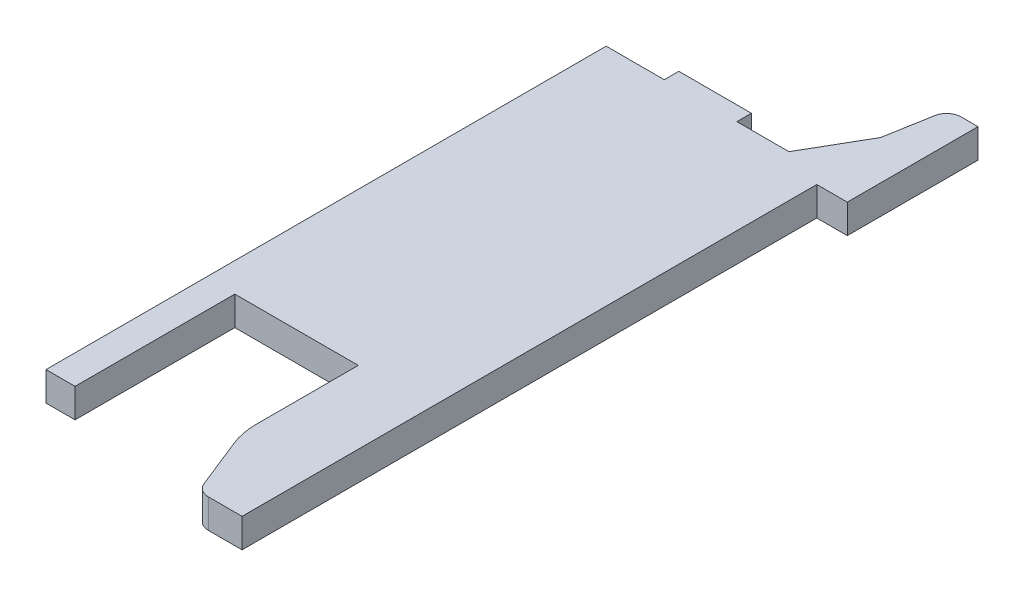
ISO-10303-21;
HEADER;
FILE_DESCRIPTION(('STEP AP214'),'2;1');
FILE_NAME('part.step','',(''),(''),'','','');
FILE_SCHEMA(('AUTOMOTIVE_DESIGN { 1 0 10303 214 1 1 1 1 }'));
ENDSEC;
DATA;
#1=APPLICATION_CONTEXT('core data for automotive mechanical design processes');
#2=APPLICATION_PROTOCOL_DEFINITION('international standard','automotive_design',2000,#1);
#3=PRODUCT_CONTEXT('',#1,'mechanical');
#4=PRODUCT('Part','Part','',(#3));
#5=PRODUCT_RELATED_PRODUCT_CATEGORY('part','',(#4));
#6=PRODUCT_DEFINITION_FORMATION('','',#4);
#7=PRODUCT_DEFINITION_CONTEXT('part definition',#1,'design');
#8=PRODUCT_DEFINITION('design','',#6,#7);
#9=PRODUCT_DEFINITION_SHAPE('','',#8);
#10=(LENGTH_UNIT() NAMED_UNIT(*) SI_UNIT(.MILLI.,.METRE.));
#11=(NAMED_UNIT(*) PLANE_ANGLE_UNIT() SI_UNIT($,.RADIAN.));
#12=(NAMED_UNIT(*) SI_UNIT($,.STERADIAN.) SOLID_ANGLE_UNIT());
#13=UNCERTAINTY_MEASURE_WITH_UNIT(LENGTH_MEASURE(1.E-05),#10,'distance_accuracy_value','');
#14=(GEOMETRIC_REPRESENTATION_CONTEXT(3) GLOBAL_UNCERTAINTY_ASSIGNED_CONTEXT((#13)) GLOBAL_UNIT_ASSIGNED_CONTEXT((#10,
#11,#12)) REPRESENTATION_CONTEXT('',''));
#15=CARTESIAN_POINT('',(0.,0.,0.));
#16=DIRECTION('',(0.,0.,1.));
#17=DIRECTION('',(1.,0.,0.));
#18=AXIS2_PLACEMENT_3D('',#15,#16,#17);
#19=CARTESIAN_POINT('',(0.868909963118,-0.1,-1.1));
#20=DIRECTION('',(0.,1.,0.));
#21=DIRECTION('',(0.,0.,1.));
#22=AXIS2_PLACEMENT_3D('',#19,#20,#21);
#23=CYLINDRICAL_SURFACE('',#22,0.1);
#24=CARTESIAN_POINT('',(0.868909963118,-0.1,-1.1));
#25=DIRECTION('',(0.,-1.,0.));
#26=DIRECTION('',(0.,0.,-1.));
#27=AXIS2_PLACEMENT_3D('',#24,#25,#26);
#28=CIRCLE('',#27,0.1);
#29=CARTESIAN_POINT('',(0.770429187817,-0.1,-1.117364817767));
#30=VERTEX_POINT('',#29);
#31=CARTESIAN_POINT('',(0.868909963118,-0.1,-1.2));
#32=VERTEX_POINT('',#31);
#33=EDGE_CURVE('E26',#30,#32,#28,.T.);
#34=ORIENTED_EDGE('',*,*,#33,.F.);
#35=DIRECTION('',(0.,-1.,0.));
#36=VECTOR('',#35,1.);
#37=CARTESIAN_POINT('',(0.770429187817,-0.1,-1.117364817767));
#38=LINE('',#37,#36);
#39=CARTESIAN_POINT('',(0.770429187817,0.1,-1.117364817767));
#40=VERTEX_POINT('',#39);
#41=EDGE_CURVE('E258',#40,#30,#38,.T.);
#42=ORIENTED_EDGE('',*,*,#41,.F.);
#43=CARTESIAN_POINT('',(0.868909963118,0.1,-1.1));
#44=DIRECTION('',(0.,1.,0.));
#45=DIRECTION('',(0.,0.,-1.));
#46=AXIS2_PLACEMENT_3D('',#43,#44,#45);
#47=CIRCLE('',#46,0.1);
#48=CARTESIAN_POINT('',(0.868909963118,0.1,-1.2));
#49=VERTEX_POINT('',#48);
#50=EDGE_CURVE('E11',#49,#40,#47,.T.);
#51=ORIENTED_EDGE('',*,*,#50,.F.);
#52=DIRECTION('',(0.,1.,0.));
#53=VECTOR('',#52,1.);
#54=CARTESIAN_POINT('',(0.868909963118,-0.1,-1.2));
#55=LINE('',#54,#53);
#56=EDGE_CURVE('E274',#32,#49,#55,.T.);
#57=ORIENTED_EDGE('',*,*,#56,.F.);
#58=EDGE_LOOP('',(#34,#42,#51,#57));
#59=FACE_BOUND('',#58,.T.);
#60=ADVANCED_FACE('F17',(#59),#23,.T.);
#61=CARTESIAN_POINT('',(0.775,0.1,3.060583310795));
#62=DIRECTION('',(0.,-1.,0.));
#63=DIRECTION('',(0.,0.,-1.));
#64=AXIS2_PLACEMENT_3D('',#61,#62,#63);
#65=PLANE('',#64);
#66=DIRECTION('',(-1.,0.,0.));
#67=VECTOR('',#66,1.);
#68=CARTESIAN_POINT('',(0.985,0.1,-1.2));
#69=LINE('',#68,#67);
#70=CARTESIAN_POINT('',(0.985,0.1,-1.2));
#71=VERTEX_POINT('',#70);
#72=EDGE_CURVE('E283',#71,#49,#69,.T.);
#73=ORIENTED_EDGE('',*,*,#72,.T.);
#74=ORIENTED_EDGE('',*,*,#50,.T.);
#75=DIRECTION('',(-0.173648177667033,0.,0.98480775301219));
#76=VECTOR('',#75,1.);
#77=CARTESIAN_POINT('',(0.785,0.1,-1.2));
#78=LINE('',#77,#76);
#79=CARTESIAN_POINT('',(0.714469207717,0.1,-0.8));
#80=VERTEX_POINT('',#79);
#81=EDGE_CURVE('E221',#40,#80,#78,.T.);
#82=ORIENTED_EDGE('',*,*,#81,.T.);
#83=DIRECTION('',(-0.50000000000019,0.,0.866025403784329));
#84=VECTOR('',#83,1.);
#85=CARTESIAN_POINT('',(0.714469207717,0.1,-0.8));
#86=LINE('',#85,#84);
#87=CARTESIAN_POINT('',(0.483529100041,0.1,-0.4));
#88=VERTEX_POINT('',#87);
#89=EDGE_CURVE('E232',#80,#88,#86,.T.);
#90=ORIENTED_EDGE('',*,*,#89,.T.);
#91=DIRECTION('',(-1.,0.,0.));
#92=VECTOR('',#91,1.);
#93=CARTESIAN_POINT('',(0.125,0.1,-0.4));
#94=LINE('',#93,#92);
#95=CARTESIAN_POINT('',(0.125,0.1,-0.4));
#96=VERTEX_POINT('',#95);
#97=EDGE_CURVE('E235',#88,#96,#94,.T.);
#98=ORIENTED_EDGE('',*,*,#97,.T.);
#99=DIRECTION('',(0.,0.,-1.));
#100=VECTOR('',#99,1.);
#101=CARTESIAN_POINT('',(0.125,0.1,-0.4));
#102=LINE('',#101,#100);
#103=CARTESIAN_POINT('',(0.125,0.1,-0.5));
#104=VERTEX_POINT('',#103);
#105=EDGE_CURVE('E373',#96,#104,#102,.T.);
#106=ORIENTED_EDGE('',*,*,#105,.T.);
#107=DIRECTION('',(-1.,0.,0.));
#108=VECTOR('',#107,1.);
#109=CARTESIAN_POINT('',(-0.375,0.1,-0.5));
#110=LINE('',#109,#108);
#111=CARTESIAN_POINT('',(-0.375,0.1,-0.5));
#112=VERTEX_POINT('',#111);
#113=EDGE_CURVE('E388',#104,#112,#110,.T.);
#114=ORIENTED_EDGE('',*,*,#113,.T.);
#115=DIRECTION('',(0.,0.,1.));
#116=VECTOR('',#115,1.);
#117=CARTESIAN_POINT('',(-0.375,0.1,-0.4));
#118=LINE('',#117,#116);
#119=CARTESIAN_POINT('',(-0.375,0.1,-0.4));
#120=VERTEX_POINT('',#119);
#121=EDGE_CURVE('E379',#112,#120,#118,.T.);
#122=ORIENTED_EDGE('',*,*,#121,.T.);
#123=DIRECTION('',(-1.,0.,0.));
#124=VECTOR('',#123,1.);
#125=CARTESIAN_POINT('',(-0.775,0.1,-0.4));
#126=LINE('',#125,#124);
#127=CARTESIAN_POINT('',(-0.775,0.1,-0.4));
#128=VERTEX_POINT('',#127);
#129=EDGE_CURVE('E365',#120,#128,#126,.T.);
#130=ORIENTED_EDGE('',*,*,#129,.T.);
#131=DIRECTION('',(0.,0.,1.));
#132=VECTOR('',#131,1.);
#133=CARTESIAN_POINT('',(-0.775,0.1,-0.4));
#134=LINE('',#133,#132);
#135=CARTESIAN_POINT('',(-0.775,0.1,3.456874512579));
#136=VERTEX_POINT('',#135);
#137=EDGE_CURVE('E424',#128,#136,#134,.T.);
#138=ORIENTED_EDGE('',*,*,#137,.T.);
#139=DIRECTION('',(1.,0.,0.));
#140=VECTOR('',#139,1.);
#141=CARTESIAN_POINT('',(-0.775,0.1,3.456874512579));
#142=LINE('',#141,#140);
#143=CARTESIAN_POINT('',(-0.575,0.1,3.456874512579));
#144=VERTEX_POINT('',#143);
#145=EDGE_CURVE('E20',#136,#144,#142,.T.);
#146=ORIENTED_EDGE('',*,*,#145,.T.);
#147=DIRECTION('',(0.,0.,-1.));
#148=VECTOR('',#147,1.);
#149=CARTESIAN_POINT('',(-0.575,0.1,2.356874512579));
#150=LINE('',#149,#148);
#151=CARTESIAN_POINT('',(-0.575,0.1,2.356874512579));
#152=VERTEX_POINT('',#151);
#153=EDGE_CURVE('E340',#144,#152,#150,.T.);
#154=ORIENTED_EDGE('',*,*,#153,.T.);
#155=DIRECTION('',(1.,0.,0.));
#156=VECTOR('',#155,1.);
#157=CARTESIAN_POINT('',(-0.575,0.1,2.356874512579));
#158=LINE('',#157,#156);
#159=CARTESIAN_POINT('',(0.275,0.1,2.356874512579));
#160=VERTEX_POINT('',#159);
#161=EDGE_CURVE('E332',#152,#160,#158,.T.);
#162=ORIENTED_EDGE('',*,*,#161,.T.);
#163=DIRECTION('',(0.,0.,1.));
#164=VECTOR('',#163,1.);
#165=CARTESIAN_POINT('',(0.275,0.1,2.356874512579));
#166=LINE('',#165,#164);
#167=CARTESIAN_POINT('',(0.275,0.1,3.060583310795));
#168=VERTEX_POINT('',#167);
#169=EDGE_CURVE('E278',#160,#168,#166,.T.);
#170=ORIENTED_EDGE('',*,*,#169,.T.);
#171=CARTESIAN_POINT('',(0.775,0.1,3.060583310795));
#172=DIRECTION('',(0.,1.,0.));
#173=DIRECTION('',(0.,0.,-1.));
#174=AXIS2_PLACEMENT_3D('',#171,#172,#173);
#175=CIRCLE('',#174,0.5);
#176=CARTESIAN_POINT('',(0.310761654557,0.1,3.246278648972));
#177=VERTEX_POINT('',#176);
#178=EDGE_CURVE('E269',#168,#177,#175,.T.);
#179=ORIENTED_EDGE('',*,*,#178,.T.);
#180=DIRECTION('',(0.371390676354104,0.,0.928476690885259));
#181=VECTOR('',#180,1.);
#182=CARTESIAN_POINT('',(0.449855627054,0.1,3.594013580214));
#183=LINE('',#182,#181);
#184=CARTESIAN_POINT('',(0.449855627054,0.1,3.594013580214));
#185=VERTEX_POINT('',#184);
#186=EDGE_CURVE('E287',#177,#185,#183,.T.);
#187=ORIENTED_EDGE('',*,*,#186,.T.);
#188=CARTESIAN_POINT('',(0.542703296143,0.1,3.556874512579));
#189=DIRECTION('',(0.,1.,0.));
#190=DIRECTION('',(0.,0.,1.));
#191=AXIS2_PLACEMENT_3D('',#188,#189,#190);
#192=CIRCLE('',#191,0.1);
#193=CARTESIAN_POINT('',(0.542703296143,0.1,3.656874512579));
#194=VERTEX_POINT('',#193);
#195=EDGE_CURVE('E313',#185,#194,#192,.T.);
#196=ORIENTED_EDGE('',*,*,#195,.T.);
#197=DIRECTION('',(1.,0.,0.));
#198=VECTOR('',#197,1.);
#199=CARTESIAN_POINT('',(0.775,0.1,3.656874512579));
#200=LINE('',#199,#198);
#201=CARTESIAN_POINT('',(0.775,0.1,3.656874512579));
#202=VERTEX_POINT('',#201);
#203=EDGE_CURVE('E305',#194,#202,#200,.T.);
#204=ORIENTED_EDGE('',*,*,#203,.T.);
#205=DIRECTION('',(0.,0.,-1.));
#206=VECTOR('',#205,1.);
#207=CARTESIAN_POINT('',(0.775,0.1,-0.3));
#208=LINE('',#207,#206);
#209=CARTESIAN_POINT('',(0.775,0.1,-0.3));
#210=VERTEX_POINT('',#209);
#211=EDGE_CURVE('E301',#202,#210,#208,.T.);
#212=ORIENTED_EDGE('',*,*,#211,.T.);
#213=DIRECTION('',(1.,0.,0.));
#214=VECTOR('',#213,1.);
#215=CARTESIAN_POINT('',(0.775,0.1,-0.3));
#216=LINE('',#215,#214);
#217=CARTESIAN_POINT('',(0.985,0.1,-0.3));
#218=VERTEX_POINT('',#217);
#219=EDGE_CURVE('E293',#210,#218,#216,.T.);
#220=ORIENTED_EDGE('',*,*,#219,.T.);
#221=DIRECTION('',(0.,0.,-1.));
#222=VECTOR('',#221,1.);
#223=CARTESIAN_POINT('',(0.985,0.1,-0.4));
#224=LINE('',#223,#222);
#225=EDGE_CURVE('E250',#218,#71,#224,.T.);
#226=ORIENTED_EDGE('',*,*,#225,.T.);
#227=EDGE_LOOP('',(#73,#74,#82,#90,#98,#106,#114,#122,#130,#138,#146,#154,#162,#170,#179,#187,
#196,#204,#212,#220,#226));
#228=FACE_BOUND('',#227,.T.);
#229=ADVANCED_FACE('F407',(#228),#65,.F.);
#230=CARTESIAN_POINT('',(0.775,-0.1,3.060583310795));
#231=DIRECTION('',(0.,-1.,0.));
#232=DIRECTION('',(0.,0.,-1.));
#233=AXIS2_PLACEMENT_3D('',#230,#231,#232);
#234=PLANE('',#233);
#235=DIRECTION('',(-0.173648177667033,0.,0.98480775301219));
#236=VECTOR('',#235,1.);
#237=CARTESIAN_POINT('',(0.785,-0.1,-1.2));
#238=LINE('',#237,#236);
#239=CARTESIAN_POINT('',(0.714469207717,-0.1,-0.8));
#240=VERTEX_POINT('',#239);
#241=EDGE_CURVE('E262',#30,#240,#238,.T.);
#242=ORIENTED_EDGE('',*,*,#241,.F.);
#243=ORIENTED_EDGE('',*,*,#33,.T.);
#244=DIRECTION('',(-1.,0.,0.));
#245=VECTOR('',#244,1.);
#246=CARTESIAN_POINT('',(0.985,-0.1,-1.2));
#247=LINE('',#246,#245);
#248=CARTESIAN_POINT('',(0.985,-0.1,-1.2));
#249=VERTEX_POINT('',#248);
#250=EDGE_CURVE('E265',#249,#32,#247,.T.);
#251=ORIENTED_EDGE('',*,*,#250,.F.);
#252=DIRECTION('',(0.,0.,-1.));
#253=VECTOR('',#252,1.);
#254=CARTESIAN_POINT('',(0.985,-0.1,-0.4));
#255=LINE('',#254,#253);
#256=CARTESIAN_POINT('',(0.985,-0.1,-0.3));
#257=VERTEX_POINT('',#256);
#258=EDGE_CURVE('E249',#257,#249,#255,.T.);
#259=ORIENTED_EDGE('',*,*,#258,.F.);
#260=DIRECTION('',(1.,0.,0.));
#261=VECTOR('',#260,1.);
#262=CARTESIAN_POINT('',(0.775,-0.1,-0.3));
#263=LINE('',#262,#261);
#264=CARTESIAN_POINT('',(0.775,-0.1,-0.3));
#265=VERTEX_POINT('',#264);
#266=EDGE_CURVE('E298',#265,#257,#263,.T.);
#267=ORIENTED_EDGE('',*,*,#266,.F.);
#268=DIRECTION('',(0.,0.,-1.));
#269=VECTOR('',#268,1.);
#270=CARTESIAN_POINT('',(0.775,-0.1,-0.3));
#271=LINE('',#270,#269);
#272=CARTESIAN_POINT('',(0.775,-0.1,3.656874512579));
#273=VERTEX_POINT('',#272);
#274=EDGE_CURVE('E302',#273,#265,#271,.T.);
#275=ORIENTED_EDGE('',*,*,#274,.F.);
#276=DIRECTION('',(1.,0.,0.));
#277=VECTOR('',#276,1.);
#278=CARTESIAN_POINT('',(0.775,-0.1,3.656874512579));
#279=LINE('',#278,#277);
#280=CARTESIAN_POINT('',(0.542703296143,-0.1,3.656874512579));
#281=VERTEX_POINT('',#280);
#282=EDGE_CURVE('E310',#281,#273,#279,.T.);
#283=ORIENTED_EDGE('',*,*,#282,.F.);
#284=CARTESIAN_POINT('',(0.542703296143,-0.1,3.556874512579));
#285=DIRECTION('',(0.,1.,0.));
#286=DIRECTION('',(0.,0.,1.));
#287=AXIS2_PLACEMENT_3D('',#284,#285,#286);
#288=CIRCLE('',#287,0.1);
#289=CARTESIAN_POINT('',(0.449855627054,-0.1,3.594013580214));
#290=VERTEX_POINT('',#289);
#291=EDGE_CURVE('E290',#290,#281,#288,.T.);
#292=ORIENTED_EDGE('',*,*,#291,.F.);
#293=DIRECTION('',(0.371390676354104,0.,0.928476690885259));
#294=VECTOR('',#293,1.);
#295=CARTESIAN_POINT('',(0.449855627054,-0.1,3.594013580214));
#296=LINE('',#295,#294);
#297=CARTESIAN_POINT('',(0.310761654557,-0.1,3.246278648972));
#298=VERTEX_POINT('',#297);
#299=EDGE_CURVE('E266',#298,#290,#296,.T.);
#300=ORIENTED_EDGE('',*,*,#299,.F.);
#301=CARTESIAN_POINT('',(0.775,-0.1,3.060583310795));
#302=DIRECTION('',(0.,1.,0.));
#303=DIRECTION('',(0.,0.,-1.));
#304=AXIS2_PLACEMENT_3D('',#301,#302,#303);
#305=CIRCLE('',#304,0.5);
#306=CARTESIAN_POINT('',(0.275,-0.1,3.060583310795));
#307=VERTEX_POINT('',#306);
#308=EDGE_CURVE('E275',#307,#298,#305,.T.);
#309=ORIENTED_EDGE('',*,*,#308,.F.);
#310=DIRECTION('',(0.,0.,1.));
#311=VECTOR('',#310,1.);
#312=CARTESIAN_POINT('',(0.275,-0.1,2.356874512579));
#313=LINE('',#312,#311);
#314=CARTESIAN_POINT('',(0.275,-0.1,2.356874512579));
#315=VERTEX_POINT('',#314);
#316=EDGE_CURVE('E329',#315,#307,#313,.T.);
#317=ORIENTED_EDGE('',*,*,#316,.F.);
#318=DIRECTION('',(1.,0.,0.));
#319=VECTOR('',#318,1.);
#320=CARTESIAN_POINT('',(-0.575,-0.1,2.356874512579));
#321=LINE('',#320,#319);
#322=CARTESIAN_POINT('',(-0.575,-0.1,2.356874512579));
#323=VERTEX_POINT('',#322);
#324=EDGE_CURVE('E339',#323,#315,#321,.T.);
#325=ORIENTED_EDGE('',*,*,#324,.F.);
#326=DIRECTION('',(0.,0.,-1.));
#327=VECTOR('',#326,1.);
#328=CARTESIAN_POINT('',(-0.575,-0.1,2.356874512579));
#329=LINE('',#328,#327);
#330=CARTESIAN_POINT('',(-0.575,-0.1,3.456874512579));
#331=VERTEX_POINT('',#330);
#332=EDGE_CURVE('E345',#331,#323,#329,.T.);
#333=ORIENTED_EDGE('',*,*,#332,.F.);
#334=DIRECTION('',(1.,0.,0.));
#335=VECTOR('',#334,1.);
#336=CARTESIAN_POINT('',(-0.775,-0.1,3.456874512579));
#337=LINE('',#336,#335);
#338=CARTESIAN_POINT('',(-0.775,-0.1,3.456874512579));
#339=VERTEX_POINT('',#338);
#340=EDGE_CURVE('E39',#339,#331,#337,.T.);
#341=ORIENTED_EDGE('',*,*,#340,.F.);
#342=DIRECTION('',(0.,0.,1.));
#343=VECTOR('',#342,1.);
#344=CARTESIAN_POINT('',(-0.775,-0.1,-0.4));
#345=LINE('',#344,#343);
#346=CARTESIAN_POINT('',(-0.775,-0.1,-0.4));
#347=VERTEX_POINT('',#346);
#348=EDGE_CURVE('E369',#347,#339,#345,.T.);
#349=ORIENTED_EDGE('',*,*,#348,.F.);
#350=DIRECTION('',(-1.,0.,0.));
#351=VECTOR('',#350,1.);
#352=CARTESIAN_POINT('',(-0.775,-0.1,-0.4));
#353=LINE('',#352,#351);
#354=CARTESIAN_POINT('',(-0.375,-0.1,-0.4));
#355=VERTEX_POINT('',#354);
#356=EDGE_CURVE('E377',#355,#347,#353,.T.);
#357=ORIENTED_EDGE('',*,*,#356,.F.);
#358=DIRECTION('',(0.,0.,1.));
#359=VECTOR('',#358,1.);
#360=CARTESIAN_POINT('',(-0.375,-0.1,-0.4));
#361=LINE('',#360,#359);
#362=CARTESIAN_POINT('',(-0.375,-0.1,-0.5));
#363=VERTEX_POINT('',#362);
#364=EDGE_CURVE('E363',#363,#355,#361,.T.);
#365=ORIENTED_EDGE('',*,*,#364,.F.);
#366=DIRECTION('',(-1.,0.,0.));
#367=VECTOR('',#366,1.);
#368=CARTESIAN_POINT('',(-0.375,-0.1,-0.5));
#369=LINE('',#368,#367);
#370=CARTESIAN_POINT('',(0.125,-0.1,-0.5));
#371=VERTEX_POINT('',#370);
#372=EDGE_CURVE('E398',#371,#363,#369,.T.);
#373=ORIENTED_EDGE('',*,*,#372,.F.);
#374=DIRECTION('',(0.,0.,-1.));
#375=VECTOR('',#374,1.);
#376=CARTESIAN_POINT('',(0.125,-0.1,-0.4));
#377=LINE('',#376,#375);
#378=CARTESIAN_POINT('',(0.125,-0.1,-0.4));
#379=VERTEX_POINT('',#378);
#380=EDGE_CURVE('E227',#379,#371,#377,.T.);
#381=ORIENTED_EDGE('',*,*,#380,.F.);
#382=DIRECTION('',(-1.,0.,0.));
#383=VECTOR('',#382,1.);
#384=CARTESIAN_POINT('',(0.125,-0.1,-0.4));
#385=LINE('',#384,#383);
#386=CARTESIAN_POINT('',(0.483529100041,-0.1,-0.4));
#387=VERTEX_POINT('',#386);
#388=EDGE_CURVE('E224',#387,#379,#385,.T.);
#389=ORIENTED_EDGE('',*,*,#388,.F.);
#390=DIRECTION('',(-0.50000000000019,0.,0.866025403784329));
#391=VECTOR('',#390,1.);
#392=CARTESIAN_POINT('',(0.714469207717,-0.1,-0.8));
#393=LINE('',#392,#391);
#394=EDGE_CURVE('E209',#240,#387,#393,.T.);
#395=ORIENTED_EDGE('',*,*,#394,.F.);
#396=EDGE_LOOP('',(#242,#243,#251,#259,#267,#275,#283,#292,#300,#309,#317,#325,#333,#341,#349,
#357,#365,#373,#381,#389,#395));
#397=FACE_BOUND('',#396,.T.);
#398=ADVANCED_FACE('F225',(#397),#234,.T.);
#399=CARTESIAN_POINT('',(-0.775,-0.1,3.456874512579));
#400=DIRECTION('',(0.,0.,1.));
#401=DIRECTION('',(1.,0.,0.));
#402=AXIS2_PLACEMENT_3D('',#399,#400,#401);
#403=PLANE('',#402);
#404=DIRECTION('',(0.,1.,0.));
#405=VECTOR('',#404,1.);
#406=CARTESIAN_POINT('',(-0.575,-0.1,3.456874512579));
#407=LINE('',#406,#405);
#408=EDGE_CURVE('E343',#331,#144,#407,.T.);
#409=ORIENTED_EDGE('',*,*,#408,.T.);
#410=ORIENTED_EDGE('',*,*,#145,.F.);
#411=DIRECTION('',(0.,1.,0.));
#412=VECTOR('',#411,1.);
#413=CARTESIAN_POINT('',(-0.775,-0.1,3.456874512579));
#414=LINE('',#413,#412);
#415=EDGE_CURVE('E437',#339,#136,#414,.T.);
#416=ORIENTED_EDGE('',*,*,#415,.F.);
#417=ORIENTED_EDGE('',*,*,#340,.T.);
#418=EDGE_LOOP('',(#409,#410,#416,#417));
#419=FACE_BOUND('',#418,.T.);
#420=ADVANCED_FACE('F629',(#419),#403,.T.);
#421=CARTESIAN_POINT('',(-0.575,-0.1,2.356874512579));
#422=DIRECTION('',(1.,0.,0.));
#423=DIRECTION('',(0.,0.,-1.));
#424=AXIS2_PLACEMENT_3D('',#421,#422,#423);
#425=PLANE('',#424);
#426=DIRECTION('',(0.,1.,0.));
#427=VECTOR('',#426,1.);
#428=CARTESIAN_POINT('',(-0.575,-0.1,2.356874512579));
#429=LINE('',#428,#427);
#430=EDGE_CURVE('E335',#323,#152,#429,.T.);
#431=ORIENTED_EDGE('',*,*,#430,.T.);
#432=ORIENTED_EDGE('',*,*,#153,.F.);
#433=ORIENTED_EDGE('',*,*,#408,.F.);
#434=ORIENTED_EDGE('',*,*,#332,.T.);
#435=EDGE_LOOP('',(#431,#432,#433,#434));
#436=FACE_BOUND('',#435,.T.);
#437=ADVANCED_FACE('F631',(#436),#425,.T.);
#438=CARTESIAN_POINT('',(-0.575,-0.1,2.356874512579));
#439=DIRECTION('',(0.,0.,1.));
#440=DIRECTION('',(1.,0.,0.));
#441=AXIS2_PLACEMENT_3D('',#438,#439,#440);
#442=PLANE('',#441);
#443=DIRECTION('',(0.,1.,0.));
#444=VECTOR('',#443,1.);
#445=CARTESIAN_POINT('',(0.275,-0.1,2.356874512579));
#446=LINE('',#445,#444);
#447=EDGE_CURVE('E325',#315,#160,#446,.T.);
#448=ORIENTED_EDGE('',*,*,#447,.T.);
#449=ORIENTED_EDGE('',*,*,#161,.F.);
#450=ORIENTED_EDGE('',*,*,#430,.F.);
#451=ORIENTED_EDGE('',*,*,#324,.T.);
#452=EDGE_LOOP('',(#448,#449,#450,#451));
#453=FACE_BOUND('',#452,.T.);
#454=ADVANCED_FACE('F637',(#453),#442,.T.);
#455=CARTESIAN_POINT('',(0.275,-0.1,2.356874512579));
#456=DIRECTION('',(-1.,0.,0.));
#457=DIRECTION('',(0.,1.,0.));
#458=AXIS2_PLACEMENT_3D('',#455,#456,#457);
#459=PLANE('',#458);
#460=DIRECTION('',(0.,1.,0.));
#461=VECTOR('',#460,1.);
#462=CARTESIAN_POINT('',(0.275,-0.1,3.060583310795));
#463=LINE('',#462,#461);
#464=EDGE_CURVE('E279',#307,#168,#463,.T.);
#465=ORIENTED_EDGE('',*,*,#464,.T.);
#466=ORIENTED_EDGE('',*,*,#169,.F.);
#467=ORIENTED_EDGE('',*,*,#447,.F.);
#468=ORIENTED_EDGE('',*,*,#316,.T.);
#469=EDGE_LOOP('',(#465,#466,#467,#468));
#470=FACE_BOUND('',#469,.T.);
#471=ADVANCED_FACE('F640',(#470),#459,.T.);
#472=CARTESIAN_POINT('',(0.775,-0.1,3.060583310795));
#473=DIRECTION('',(0.,1.,0.));
#474=DIRECTION('',(0.,0.,1.));
#475=AXIS2_PLACEMENT_3D('',#472,#473,#474);
#476=CYLINDRICAL_SURFACE('',#475,0.5);
#477=DIRECTION('',(0.,1.,0.));
#478=VECTOR('',#477,1.);
#479=CARTESIAN_POINT('',(0.310761654557,-0.1,3.246278648972));
#480=LINE('',#479,#478);
#481=EDGE_CURVE('E270',#298,#177,#480,.T.);
#482=ORIENTED_EDGE('',*,*,#481,.T.);
#483=ORIENTED_EDGE('',*,*,#178,.F.);
#484=ORIENTED_EDGE('',*,*,#464,.F.);
#485=ORIENTED_EDGE('',*,*,#308,.T.);
#486=EDGE_LOOP('',(#482,#483,#484,#485));
#487=FACE_BOUND('',#486,.T.);
#488=ADVANCED_FACE('F645',(#487),#476,.T.);
#489=CARTESIAN_POINT('',(0.449855627054,-0.1,3.594013580214));
#490=DIRECTION('',(-0.928476690885259,0.,0.371390676354104));
#491=DIRECTION('',(0.,1.,0.));
#492=AXIS2_PLACEMENT_3D('',#489,#490,#491);
#493=PLANE('',#492);
#494=DIRECTION('',(0.,1.,0.));
#495=VECTOR('',#494,1.);
#496=CARTESIAN_POINT('',(0.449855627054,-0.1,3.594013580214));
#497=LINE('',#496,#495);
#498=EDGE_CURVE('E316',#290,#185,#497,.T.);
#499=ORIENTED_EDGE('',*,*,#498,.T.);
#500=ORIENTED_EDGE('',*,*,#186,.F.);
#501=ORIENTED_EDGE('',*,*,#481,.F.);
#502=ORIENTED_EDGE('',*,*,#299,.T.);
#503=EDGE_LOOP('',(#499,#500,#501,#502));
#504=FACE_BOUND('',#503,.T.);
#505=ADVANCED_FACE('F651',(#504),#493,.T.);
#506=CARTESIAN_POINT('',(0.542703296143,-0.1,3.556874512579));
#507=DIRECTION('',(0.,1.,0.));
#508=DIRECTION('',(0.,0.,1.));
#509=AXIS2_PLACEMENT_3D('',#506,#507,#508);
#510=CYLINDRICAL_SURFACE('',#509,0.1);
#511=DIRECTION('',(0.,1.,0.));
#512=VECTOR('',#511,1.);
#513=CARTESIAN_POINT('',(0.542703296143,-0.1,3.656874512579));
#514=LINE('',#513,#512);
#515=EDGE_CURVE('E309',#281,#194,#514,.T.);
#516=ORIENTED_EDGE('',*,*,#515,.T.);
#517=ORIENTED_EDGE('',*,*,#195,.F.);
#518=ORIENTED_EDGE('',*,*,#498,.F.);
#519=ORIENTED_EDGE('',*,*,#291,.T.);
#520=EDGE_LOOP('',(#516,#517,#518,#519));
#521=FACE_BOUND('',#520,.T.);
#522=ADVANCED_FACE('F655',(#521),#510,.T.);
#523=CARTESIAN_POINT('',(0.775,-0.1,3.656874512579));
#524=DIRECTION('',(0.,0.,1.));
#525=DIRECTION('',(1.,0.,0.));
#526=AXIS2_PLACEMENT_3D('',#523,#524,#525);
#527=PLANE('',#526);
#528=DIRECTION('',(0.,1.,0.));
#529=VECTOR('',#528,1.);
#530=CARTESIAN_POINT('',(0.775,-0.1,3.656874512579));
#531=LINE('',#530,#529);
#532=EDGE_CURVE('E306',#273,#202,#531,.T.);
#533=ORIENTED_EDGE('',*,*,#532,.T.);
#534=ORIENTED_EDGE('',*,*,#203,.F.);
#535=ORIENTED_EDGE('',*,*,#515,.F.);
#536=ORIENTED_EDGE('',*,*,#282,.T.);
#537=EDGE_LOOP('',(#533,#534,#535,#536));
#538=FACE_BOUND('',#537,.T.);
#539=ADVANCED_FACE('F657',(#538),#527,.T.);
#540=CARTESIAN_POINT('',(0.775,-0.1,-0.3));
#541=DIRECTION('',(1.,0.,0.));
#542=DIRECTION('',(0.,0.,-1.));
#543=AXIS2_PLACEMENT_3D('',#540,#541,#542);
#544=PLANE('',#543);
#545=DIRECTION('',(0.,1.,0.));
#546=VECTOR('',#545,1.);
#547=CARTESIAN_POINT('',(0.775,-0.1,-0.3));
#548=LINE('',#547,#546);
#549=EDGE_CURVE('E294',#265,#210,#548,.T.);
#550=ORIENTED_EDGE('',*,*,#549,.T.);
#551=ORIENTED_EDGE('',*,*,#211,.F.);
#552=ORIENTED_EDGE('',*,*,#532,.F.);
#553=ORIENTED_EDGE('',*,*,#274,.T.);
#554=EDGE_LOOP('',(#550,#551,#552,#553));
#555=FACE_BOUND('',#554,.T.);
#556=ADVANCED_FACE('F489',(#555),#544,.T.);
#557=CARTESIAN_POINT('',(0.775,-0.1,-0.3));
#558=DIRECTION('',(0.,0.,1.));
#559=DIRECTION('',(1.,0.,0.));
#560=AXIS2_PLACEMENT_3D('',#557,#558,#559);
#561=PLANE('',#560);
#562=DIRECTION('',(0.,1.,0.));
#563=VECTOR('',#562,1.);
#564=CARTESIAN_POINT('',(0.985,-0.1,-0.3));
#565=LINE('',#564,#563);
#566=EDGE_CURVE('E246',#257,#218,#565,.T.);
#567=ORIENTED_EDGE('',*,*,#566,.T.);
#568=ORIENTED_EDGE('',*,*,#219,.F.);
#569=ORIENTED_EDGE('',*,*,#549,.F.);
#570=ORIENTED_EDGE('',*,*,#266,.T.);
#571=EDGE_LOOP('',(#567,#568,#569,#570));
#572=FACE_BOUND('',#571,.T.);
#573=ADVANCED_FACE('F468',(#572),#561,.T.);
#574=CARTESIAN_POINT('',(0.985,-0.1,-0.4));
#575=DIRECTION('',(1.,0.,0.));
#576=DIRECTION('',(0.,1.,0.));
#577=AXIS2_PLACEMENT_3D('',#574,#575,#576);
#578=PLANE('',#577);
#579=DIRECTION('',(0.,1.,0.));
#580=VECTOR('',#579,1.);
#581=CARTESIAN_POINT('',(0.985,-0.1,-1.2));
#582=LINE('',#581,#580);
#583=EDGE_CURVE('E245',#249,#71,#582,.T.);
#584=ORIENTED_EDGE('',*,*,#583,.T.);
#585=ORIENTED_EDGE('',*,*,#225,.F.);
#586=ORIENTED_EDGE('',*,*,#566,.F.);
#587=ORIENTED_EDGE('',*,*,#258,.T.);
#588=EDGE_LOOP('',(#584,#585,#586,#587));
#589=FACE_BOUND('',#588,.T.);
#590=ADVANCED_FACE('F472',(#589),#578,.T.);
#591=CARTESIAN_POINT('',(0.985,-0.1,-1.2));
#592=DIRECTION('',(0.,0.,-1.));
#593=DIRECTION('',(0.,-1.,0.));
#594=AXIS2_PLACEMENT_3D('',#591,#592,#593);
#595=PLANE('',#594);
#596=ORIENTED_EDGE('',*,*,#250,.T.);
#597=ORIENTED_EDGE('',*,*,#56,.T.);
#598=ORIENTED_EDGE('',*,*,#72,.F.);
#599=ORIENTED_EDGE('',*,*,#583,.F.);
#600=EDGE_LOOP('',(#596,#597,#598,#599));
#601=FACE_BOUND('',#600,.T.);
#602=ADVANCED_FACE('F478',(#601),#595,.T.);
#603=CARTESIAN_POINT('',(0.785,-0.1,-1.2));
#604=DIRECTION('',(-0.98480775301219,0.,-0.173648177667033));
#605=DIRECTION('',(-0.173648177667033,0.,0.98480775301219));
#606=AXIS2_PLACEMENT_3D('',#603,#604,#605);
#607=PLANE('',#606);
#608=ORIENTED_EDGE('',*,*,#81,.F.);
#609=ORIENTED_EDGE('',*,*,#41,.T.);
#610=ORIENTED_EDGE('',*,*,#241,.T.);
#611=DIRECTION('',(0.,1.,0.));
#612=VECTOR('',#611,1.);
#613=CARTESIAN_POINT('',(0.714469207717,-0.1,-0.8));
#614=LINE('',#613,#612);
#615=EDGE_CURVE('E217',#240,#80,#614,.T.);
#616=ORIENTED_EDGE('',*,*,#615,.T.);
#617=EDGE_LOOP('',(#608,#609,#610,#616));
#618=FACE_BOUND('',#617,.T.);
#619=ADVANCED_FACE('F484',(#618),#607,.T.);
#620=CARTESIAN_POINT('',(0.714469207717,-0.1,-0.8));
#621=DIRECTION('',(-0.866025403784329,0.,-0.50000000000019));
#622=DIRECTION('',(-0.50000000000019,0.,0.866025403784329));
#623=AXIS2_PLACEMENT_3D('',#620,#621,#622);
#624=PLANE('',#623);
#625=DIRECTION('',(0.,1.,0.));
#626=VECTOR('',#625,1.);
#627=CARTESIAN_POINT('',(0.483529100041,-0.1,-0.4));
#628=LINE('',#627,#626);
#629=EDGE_CURVE('E214',#387,#88,#628,.T.);
#630=ORIENTED_EDGE('',*,*,#629,.T.);
#631=ORIENTED_EDGE('',*,*,#89,.F.);
#632=ORIENTED_EDGE('',*,*,#615,.F.);
#633=ORIENTED_EDGE('',*,*,#394,.T.);
#634=EDGE_LOOP('',(#630,#631,#632,#633));
#635=FACE_BOUND('',#634,.T.);
#636=ADVANCED_FACE('F211',(#635),#624,.T.);
#637=CARTESIAN_POINT('',(0.125,-0.1,-0.4));
#638=DIRECTION('',(0.,0.,-1.));
#639=DIRECTION('',(-1.,0.,0.));
#640=AXIS2_PLACEMENT_3D('',#637,#638,#639);
#641=PLANE('',#640);
#642=DIRECTION('',(0.,1.,0.));
#643=VECTOR('',#642,1.);
#644=CARTESIAN_POINT('',(0.125,-0.1,-0.4));
#645=LINE('',#644,#643);
#646=EDGE_CURVE('E370',#379,#96,#645,.T.);
#647=ORIENTED_EDGE('',*,*,#646,.T.);
#648=ORIENTED_EDGE('',*,*,#97,.F.);
#649=ORIENTED_EDGE('',*,*,#629,.F.);
#650=ORIENTED_EDGE('',*,*,#388,.T.);
#651=EDGE_LOOP('',(#647,#648,#649,#650));
#652=FACE_BOUND('',#651,.T.);
#653=ADVANCED_FACE('F234',(#652),#641,.T.);
#654=CARTESIAN_POINT('',(0.125,-0.1,-0.4));
#655=DIRECTION('',(1.,0.,0.));
#656=DIRECTION('',(0.,1.,0.));
#657=AXIS2_PLACEMENT_3D('',#654,#655,#656);
#658=PLANE('',#657);
#659=DIRECTION('',(0.,1.,0.));
#660=VECTOR('',#659,1.);
#661=CARTESIAN_POINT('',(0.125,-0.1,-0.5));
#662=LINE('',#661,#660);
#663=EDGE_CURVE('E391',#371,#104,#662,.T.);
#664=ORIENTED_EDGE('',*,*,#663,.T.);
#665=ORIENTED_EDGE('',*,*,#105,.F.);
#666=ORIENTED_EDGE('',*,*,#646,.F.);
#667=ORIENTED_EDGE('',*,*,#380,.T.);
#668=EDGE_LOOP('',(#664,#665,#666,#667));
#669=FACE_BOUND('',#668,.T.);
#670=ADVANCED_FACE('F411',(#669),#658,.T.);
#671=CARTESIAN_POINT('',(-0.375,-0.1,-0.5));
#672=DIRECTION('',(0.,0.,-1.));
#673=DIRECTION('',(0.,-1.,0.));
#674=AXIS2_PLACEMENT_3D('',#671,#672,#673);
#675=PLANE('',#674);
#676=DIRECTION('',(0.,1.,0.));
#677=VECTOR('',#676,1.);
#678=CARTESIAN_POINT('',(-0.375,-0.1,-0.5));
#679=LINE('',#678,#677);
#680=EDGE_CURVE('E385',#363,#112,#679,.T.);
#681=ORIENTED_EDGE('',*,*,#680,.T.);
#682=ORIENTED_EDGE('',*,*,#113,.F.);
#683=ORIENTED_EDGE('',*,*,#663,.F.);
#684=ORIENTED_EDGE('',*,*,#372,.T.);
#685=EDGE_LOOP('',(#681,#682,#683,#684));
#686=FACE_BOUND('',#685,.T.);
#687=ADVANCED_FACE('F413',(#686),#675,.T.);
#688=CARTESIAN_POINT('',(-0.375,-0.1,-0.4));
#689=DIRECTION('',(-1.,0.,0.));
#690=DIRECTION('',(0.,0.,1.));
#691=AXIS2_PLACEMENT_3D('',#688,#689,#690);
#692=PLANE('',#691);
#693=DIRECTION('',(0.,1.,0.));
#694=VECTOR('',#693,1.);
#695=CARTESIAN_POINT('',(-0.375,-0.1,-0.4));
#696=LINE('',#695,#694);
#697=EDGE_CURVE('E368',#355,#120,#696,.T.);
#698=ORIENTED_EDGE('',*,*,#697,.T.);
#699=ORIENTED_EDGE('',*,*,#121,.F.);
#700=ORIENTED_EDGE('',*,*,#680,.F.);
#701=ORIENTED_EDGE('',*,*,#364,.T.);
#702=EDGE_LOOP('',(#698,#699,#700,#701));
#703=FACE_BOUND('',#702,.T.);
#704=ADVANCED_FACE('F419',(#703),#692,.T.);
#705=CARTESIAN_POINT('',(-0.775,-0.1,-0.4));
#706=DIRECTION('',(0.,0.,-1.));
#707=DIRECTION('',(0.,-1.,0.));
#708=AXIS2_PLACEMENT_3D('',#705,#706,#707);
#709=PLANE('',#708);
#710=DIRECTION('',(0.,1.,0.));
#711=VECTOR('',#710,1.);
#712=CARTESIAN_POINT('',(-0.775,-0.1,-0.4));
#713=LINE('',#712,#711);
#714=EDGE_CURVE('E428',#347,#128,#713,.T.);
#715=ORIENTED_EDGE('',*,*,#714,.T.);
#716=ORIENTED_EDGE('',*,*,#129,.F.);
#717=ORIENTED_EDGE('',*,*,#697,.F.);
#718=ORIENTED_EDGE('',*,*,#356,.T.);
#719=EDGE_LOOP('',(#715,#716,#717,#718));
#720=FACE_BOUND('',#719,.T.);
#721=ADVANCED_FACE('F429',(#720),#709,.T.);
#722=CARTESIAN_POINT('',(-0.775,-0.1,-0.4));
#723=DIRECTION('',(-1.,0.,0.));
#724=DIRECTION('',(0.,1.,0.));
#725=AXIS2_PLACEMENT_3D('',#722,#723,#724);
#726=PLANE('',#725);
#727=ORIENTED_EDGE('',*,*,#415,.T.);
#728=ORIENTED_EDGE('',*,*,#137,.F.);
#729=ORIENTED_EDGE('',*,*,#714,.F.);
#730=ORIENTED_EDGE('',*,*,#348,.T.);
#731=EDGE_LOOP('',(#727,#728,#729,#730));
#732=FACE_BOUND('',#731,.T.);
#733=ADVANCED_FACE('F436',(#732),#726,.T.);
#734=CLOSED_SHELL('',(#60,#229,#398,#420,#437,#454,#471,#488,#505,#522,#539,#556,#573,#590,#602,
#619,#636,#653,#670,#687,#704,#721,#733));
#735=MANIFOLD_SOLID_BREP('B1',#734);
#736=ADVANCED_BREP_SHAPE_REPRESENTATION('',(#18,#735),#14);
#737=SHAPE_DEFINITION_REPRESENTATION(#9,#736);
ENDSEC;
END-ISO-10303-21;
